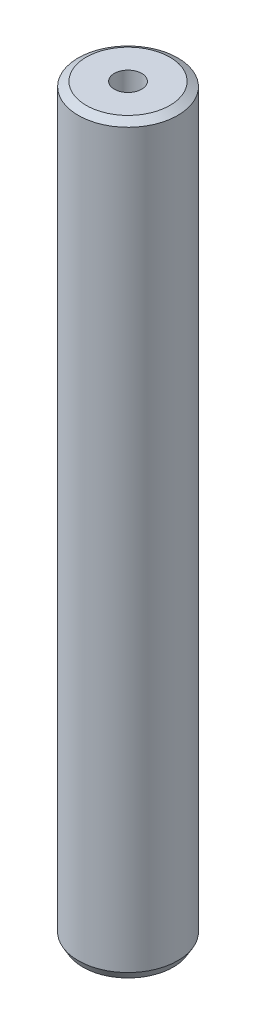
ISO-10303-21;
HEADER;
FILE_DESCRIPTION(('STEP AP214'),'2;1');
FILE_NAME('part.step','',(''),(''),'','','');
FILE_SCHEMA(('AUTOMOTIVE_DESIGN { 1 0 10303 214 1 1 1 1 }'));
ENDSEC;
DATA;
#1=APPLICATION_CONTEXT('core data for automotive mechanical design processes');
#2=APPLICATION_PROTOCOL_DEFINITION('international standard','automotive_design',2000,#1);
#3=PRODUCT_CONTEXT('',#1,'mechanical');
#4=PRODUCT('Part','Part','',(#3));
#5=PRODUCT_RELATED_PRODUCT_CATEGORY('part','',(#4));
#6=PRODUCT_DEFINITION_FORMATION('','',#4);
#7=PRODUCT_DEFINITION_CONTEXT('part definition',#1,'design');
#8=PRODUCT_DEFINITION('design','',#6,#7);
#9=PRODUCT_DEFINITION_SHAPE('','',#8);
#10=(LENGTH_UNIT() NAMED_UNIT(*) SI_UNIT(.MILLI.,.METRE.));
#11=(NAMED_UNIT(*) PLANE_ANGLE_UNIT() SI_UNIT($,.RADIAN.));
#12=(NAMED_UNIT(*) SI_UNIT($,.STERADIAN.) SOLID_ANGLE_UNIT());
#13=UNCERTAINTY_MEASURE_WITH_UNIT(LENGTH_MEASURE(1.E-05),#10,'distance_accuracy_value','');
#14=(GEOMETRIC_REPRESENTATION_CONTEXT(3) GLOBAL_UNCERTAINTY_ASSIGNED_CONTEXT((#13)) GLOBAL_UNIT_ASSIGNED_CONTEXT((#10,
#11,#12)) REPRESENTATION_CONTEXT('',''));
#15=CARTESIAN_POINT('',(0.,0.,0.));
#16=DIRECTION('',(0.,0.,1.));
#17=DIRECTION('',(1.,0.,0.));
#18=AXIS2_PLACEMENT_3D('',#15,#16,#17);
#19=CARTESIAN_POINT('',(0.,261.607179481802,0.));
#20=DIRECTION('',(0.,-1.,0.));
#21=DIRECTION('',(0.,0.,-1.));
#22=AXIS2_PLACEMENT_3D('',#19,#20,#21);
#23=CYLINDRICAL_SURFACE('',#22,17.5);
#24=CARTESIAN_POINT('',(0.,259.985666948816,0.));
#25=DIRECTION('',(0.,1.,0.));
#26=DIRECTION('',(0.,0.,1.));
#27=AXIS2_PLACEMENT_3D('',#24,#25,#26);
#28=CIRCLE('',#27,17.5);
#29=CARTESIAN_POINT('',(0.,259.985666948816,-17.5000000000001));
#30=VERTEX_POINT('',#29);
#31=EDGE_CURVE('E50',#30,#30,#28,.F.);
#32=ORIENTED_EDGE('',*,*,#31,.T.);
#33=EDGE_LOOP('',(#32));
#34=FACE_BOUND('',#33,.T.);
#35=CARTESIAN_POINT('',(0.,2.80854209224174,0.));
#36=DIRECTION('',(0.,1.,0.));
#37=DIRECTION('',(0.,0.,1.));
#38=AXIS2_PLACEMENT_3D('',#35,#36,#37);
#39=CIRCLE('',#38,17.5);
#40=CARTESIAN_POINT('',(0.,2.80854209224174,17.5));
#41=VERTEX_POINT('',#40);
#42=EDGE_CURVE('E51',#41,#41,#39,.T.);
#43=ORIENTED_EDGE('',*,*,#42,.T.);
#44=EDGE_LOOP('',(#43));
#45=FACE_BOUND('',#44,.T.);
#46=ADVANCED_FACE('F39',(#34,#45),#23,.T.);
#47=CARTESIAN_POINT('',(0.,261.607179481802,0.));
#48=DIRECTION('',(0.,1.,0.));
#49=DIRECTION('',(0.,0.,1.));
#50=AXIS2_PLACEMENT_3D('',#47,#48,#49);
#51=PLANE('',#50);
#52=CARTESIAN_POINT('',(0.,261.607179481802,0.));
#53=DIRECTION('',(0.,1.,0.));
#54=DIRECTION('',(0.,0.,1.));
#55=AXIS2_PLACEMENT_3D('',#52,#53,#54);
#56=CIRCLE('',#55,14.6914579077583);
#57=CARTESIAN_POINT('',(0.,261.607179481802,-14.6914579077584));
#58=VERTEX_POINT('',#57);
#59=EDGE_CURVE('E54',#58,#58,#56,.T.);
#60=ORIENTED_EDGE('',*,*,#59,.T.);
#61=EDGE_LOOP('',(#60));
#62=FACE_BOUND('',#61,.T.);
#63=CARTESIAN_POINT('',(0.,261.607179481802,0.));
#64=DIRECTION('',(0.,1.,0.));
#65=DIRECTION('',(0.,0.,1.));
#66=AXIS2_PLACEMENT_3D('',#63,#64,#65);
#67=CIRCLE('',#66,4.8208616958935);
#68=CARTESIAN_POINT('',(0.,261.607179481802,4.8208616958935));
#69=VERTEX_POINT('',#68);
#70=EDGE_CURVE('E58',#69,#69,#67,.T.);
#71=ORIENTED_EDGE('',*,*,#70,.F.);
#72=EDGE_LOOP('',(#71));
#73=FACE_BOUND('',#72,.T.);
#74=ADVANCED_FACE('F69',(#62,#73),#51,.T.);
#75=CARTESIAN_POINT('',(0.,0.,0.));
#76=DIRECTION('',(0.,1.,0.));
#77=DIRECTION('',(0.,0.,1.));
#78=AXIS2_PLACEMENT_3D('',#75,#76,#77);
#79=PLANE('',#78);
#80=CARTESIAN_POINT('',(0.,0.,0.));
#81=DIRECTION('',(0.,1.,0.));
#82=DIRECTION('',(0.,0.,1.));
#83=AXIS2_PLACEMENT_3D('',#80,#81,#82);
#84=CIRCLE('',#83,15.8784874670138);
#85=CARTESIAN_POINT('',(0.,0.,15.8784874670138));
#86=VERTEX_POINT('',#85);
#87=EDGE_CURVE('E10',#86,#86,#84,.F.);
#88=ORIENTED_EDGE('',*,*,#87,.T.);
#89=EDGE_LOOP('',(#88));
#90=FACE_BOUND('',#89,.T.);
#91=CARTESIAN_POINT('',(0.,0.,0.));
#92=DIRECTION('',(0.,1.,0.));
#93=DIRECTION('',(0.,0.,1.));
#94=AXIS2_PLACEMENT_3D('',#91,#92,#93);
#95=CIRCLE('',#94,4.8208616958935);
#96=CARTESIAN_POINT('',(0.,0.,4.8208616958935));
#97=VERTEX_POINT('',#96);
#98=EDGE_CURVE('E63',#97,#97,#95,.T.);
#99=ORIENTED_EDGE('',*,*,#98,.T.);
#100=EDGE_LOOP('',(#99));
#101=FACE_BOUND('',#100,.T.);
#102=ADVANCED_FACE('F75',(#90,#101),#79,.F.);
#103=CARTESIAN_POINT('',(0.,261.607179481802,0.));
#104=DIRECTION('',(0.,-1.,0.));
#105=DIRECTION('',(0.,0.,-1.));
#106=AXIS2_PLACEMENT_3D('',#103,#104,#105);
#107=CYLINDRICAL_SURFACE('',#106,4.8208616958935);
#108=ORIENTED_EDGE('',*,*,#70,.T.);
#109=EDGE_LOOP('',(#108));
#110=FACE_BOUND('',#109,.T.);
#111=ORIENTED_EDGE('',*,*,#98,.F.);
#112=EDGE_LOOP('',(#111));
#113=FACE_BOUND('',#112,.T.);
#114=ADVANCED_FACE('F70',(#110,#113),#107,.F.);
#115=CARTESIAN_POINT('',(0.,261.607179481802,0.));
#116=DIRECTION('',(0.,-1.,0.));
#117=DIRECTION('',(0.,0.,-1.));
#118=AXIS2_PLACEMENT_3D('',#115,#116,#117);
#119=CONICAL_SURFACE('',#118,14.6914579077583,1.04719755119658);
#120=CARTESIAN_POINT('',(0.,259.985666948816,-17.5000000000001));
#121=CARTESIAN_POINT('',(0.,260.002557704368,-17.4707443532059));
#122=CARTESIAN_POINT('',(0.,260.019448459919,-17.4414887064117));
#123=CARTESIAN_POINT('',(0.,260.053229971023,-17.3829774128233));
#124=CARTESIAN_POINT('',(0.,260.070120726575,-17.3537217660291));
#125=CARTESIAN_POINT('',(0.,260.103902237679,-17.2952104724408));
#126=CARTESIAN_POINT('',(0.,260.120792993231,-17.2659548256466));
#127=CARTESIAN_POINT('',(0.,260.154574504335,-17.2074435320582));
#128=CARTESIAN_POINT('',(0.,260.171465259887,-17.178187885264));
#129=CARTESIAN_POINT('',(0.,260.205246770991,-17.1196765916757));
#130=CARTESIAN_POINT('',(0.,260.222137526543,-17.0904209448815));
#131=CARTESIAN_POINT('',(0.,260.255919037647,-17.0319096512931));
#132=CARTESIAN_POINT('',(0.,260.272809793199,-17.0026540044989));
#133=CARTESIAN_POINT('',(0.,260.306591304302,-16.9441427109106));
#134=CARTESIAN_POINT('',(0.,260.323482059854,-16.9148870641164));
#135=CARTESIAN_POINT('',(0.,260.357263570958,-16.856375770528));
#136=CARTESIAN_POINT('',(0.,260.37415432651,-16.8271201237338));
#137=CARTESIAN_POINT('',(0.,260.407935837614,-16.7686088301455));
#138=CARTESIAN_POINT('',(0.,260.424826593166,-16.7393531833513));
#139=CARTESIAN_POINT('',(0.,260.45860810427,-16.6808418897629));
#140=CARTESIAN_POINT('',(0.,260.475498859822,-16.6515862429687));
#141=CARTESIAN_POINT('',(0.,260.509280370926,-16.5930749493803));
#142=CARTESIAN_POINT('',(0.,260.526171126478,-16.5638193025862));
#143=CARTESIAN_POINT('',(0.,260.559952637582,-16.5053080089978));
#144=CARTESIAN_POINT('',(0.,260.576843393133,-16.4760523622036));
#145=CARTESIAN_POINT('',(0.,260.610624904237,-16.4175410686152));
#146=CARTESIAN_POINT('',(0.,260.627515659789,-16.3882854218211));
#147=CARTESIAN_POINT('',(0.,260.661297170893,-16.3297741282327));
#148=CARTESIAN_POINT('',(0.,260.678187926445,-16.3005184814385));
#149=CARTESIAN_POINT('',(0.,260.711969437549,-16.2420071878501));
#150=CARTESIAN_POINT('',(0.,260.728860193101,-16.212751541056));
#151=CARTESIAN_POINT('',(0.,260.762641704205,-16.1542402474676));
#152=CARTESIAN_POINT('',(0.,260.779532459757,-16.1249846006734));
#153=CARTESIAN_POINT('',(0.,260.813313970861,-16.066473307085));
#154=CARTESIAN_POINT('',(0.,260.830204726413,-16.0372176602909));
#155=CARTESIAN_POINT('',(0.,260.863986237516,-15.9787063667025));
#156=CARTESIAN_POINT('',(0.,260.880876993068,-15.9494507199083));
#157=CARTESIAN_POINT('',(0.,260.914658504172,-15.8909394263199));
#158=CARTESIAN_POINT('',(0.,260.931549259724,-15.8616837795257));
#159=CARTESIAN_POINT('',(0.,260.965330770828,-15.8031724859374));
#160=CARTESIAN_POINT('',(0.,260.98222152638,-15.7739168391432));
#161=CARTESIAN_POINT('',(0.,261.016003037484,-15.7154055455548));
#162=CARTESIAN_POINT('',(0.,261.032893793036,-15.6861498987606));
#163=CARTESIAN_POINT('',(0.,261.06667530414,-15.6276386051723));
#164=CARTESIAN_POINT('',(0.,261.083566059692,-15.5983829583781));
#165=CARTESIAN_POINT('',(0.,261.117347570796,-15.5398716647897));
#166=CARTESIAN_POINT('',(0.,261.134238326348,-15.5106160179955));
#167=CARTESIAN_POINT('',(0.,261.168019837451,-15.4521047244072));
#168=CARTESIAN_POINT('',(0.,261.184910593003,-15.422849077613));
#169=CARTESIAN_POINT('',(0.,261.218692104107,-15.3643377840246));
#170=CARTESIAN_POINT('',(0.,261.235582859659,-15.3350821372304));
#171=CARTESIAN_POINT('',(0.,261.269364370763,-15.2765708436421));
#172=CARTESIAN_POINT('',(0.,261.286255126315,-15.2473151968479));
#173=CARTESIAN_POINT('',(0.,261.320036637419,-15.1888039032595));
#174=CARTESIAN_POINT('',(0.,261.336927392971,-15.1595482564653));
#175=CARTESIAN_POINT('',(0.,261.370708904075,-15.101036962877));
#176=CARTESIAN_POINT('',(0.,261.387599659627,-15.0717813160828));
#177=CARTESIAN_POINT('',(0.,261.421381170731,-15.0132700224944));
#178=CARTESIAN_POINT('',(0.,261.438271926282,-14.9840143757002));
#179=CARTESIAN_POINT('',(0.,261.472053437386,-14.9255030821119));
#180=CARTESIAN_POINT('',(0.,261.488944192938,-14.8962474353177));
#181=CARTESIAN_POINT('',(0.,261.522725704042,-14.8377361417293));
#182=CARTESIAN_POINT('',(0.,261.539616459594,-14.8084804949351));
#183=CARTESIAN_POINT('',(0.,261.573397970698,-14.7499692013468));
#184=CARTESIAN_POINT('',(0.,261.59028872625,-14.7207135545526));
#185=CARTESIAN_POINT('',(0.,261.607179481802,-14.6914579077584));
#186=B_SPLINE_CURVE_WITH_KNOTS('',3,(#120,#121,#122,#123,#124,#125,#126,#127,#128,#129,#130,
#131,#132,#133,#134,#135,#136,#137,#138,#139,#140,#141,#142,#143,#144,#145,#146,#147,#148,#149,
#150,#151,#152,#153,#154,#155,#156,#157,#158,#159,#160,#161,#162,#163,#164,#165,#166,#167,#168,
#169,#170,#171,#172,#173,#174,#175,#176,#177,#178,#179,#180,#181,#182,#183,#184,#185),
.UNSPECIFIED.,.F.,.F.,(4,2,2,2,2,2,2,2,2,2,2,2,2,2,2,2,2,2,2,2,2,2,2,2,2,2,2,2,2,2,2,2,4),(0.,
0.101344533311644,0.202689066623288,0.304033599934904,0.405378133246545,0.506722666558188,
0.608067199869805,0.709411733181448,0.810756266493092,0.912100799804708,1.01344533311635,
1.114789866428,1.21613439973961,1.31747893305126,1.4188234663629,1.52016799967452,
1.62151253298616,1.7228570662978,1.82420159960942,1.92554613292106,2.02689066623271,
2.12823519954432,2.22957973285597,2.33092426616761,2.43226879947922,2.53361333279087,
2.63495786610251,2.73630239941413,2.83764693272577,2.93899146603741,3.04033599934903,
3.14168053266067,3.24302506597232),.UNSPECIFIED.);
#187=EDGE_CURVE('BSEAM81',#30,#58,#186,.T.);
#188=ORIENTED_EDGE('',*,*,#31,.F.);
#189=ORIENTED_EDGE('',*,*,#59,.F.);
#190=ORIENTED_EDGE('',*,*,#187,.T.);
#191=ORIENTED_EDGE('',*,*,#187,.F.);
#192=EDGE_LOOP('',(#188,#190,#189,#191));
#193=FACE_BOUND('',#192,.T.);
#194=ADVANCED_FACE('F81',(#193),#119,.T.);
#195=CARTESIAN_POINT('',(0.,2.80854209224174,0.));
#196=DIRECTION('',(0.,1.,0.));
#197=DIRECTION('',(0.,0.,1.));
#198=AXIS2_PLACEMENT_3D('',#195,#196,#197);
#199=CONICAL_SURFACE('',#198,17.5,0.523598775598299);
#200=ORIENTED_EDGE('',*,*,#87,.F.);
#201=EDGE_LOOP('',(#200));
#202=FACE_BOUND('',#201,.T.);
#203=ORIENTED_EDGE('',*,*,#42,.F.);
#204=EDGE_LOOP('',(#203));
#205=FACE_BOUND('',#204,.T.);
#206=ADVANCED_FACE('F45',(#202,#205),#199,.T.);
#207=CLOSED_SHELL('',(#46,#74,#102,#114,#194,#206));
#208=MANIFOLD_SOLID_BREP('B2',#207);
#209=ADVANCED_BREP_SHAPE_REPRESENTATION('',(#18,#208),#14);
#210=SHAPE_DEFINITION_REPRESENTATION(#9,#209);
ENDSEC;
END-ISO-10303-21;
